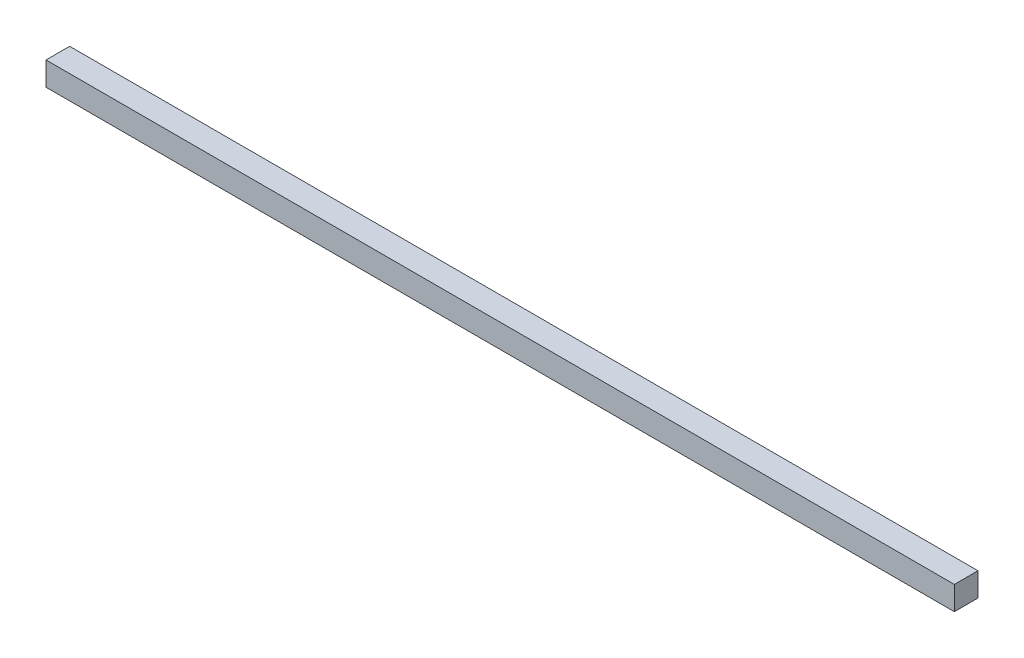
ISO-10303-21;
HEADER;
FILE_DESCRIPTION(('STEP AP214'),'2;1');
FILE_NAME('part.step','',(''),(''),'','','');
FILE_SCHEMA(('AUTOMOTIVE_DESIGN { 1 0 10303 214 1 1 1 1 }'));
ENDSEC;
DATA;
#1=APPLICATION_CONTEXT('core data for automotive mechanical design processes');
#2=APPLICATION_PROTOCOL_DEFINITION('international standard','automotive_design',2000,#1);
#3=PRODUCT_CONTEXT('',#1,'mechanical');
#4=PRODUCT('Part','Part','',(#3));
#5=PRODUCT_RELATED_PRODUCT_CATEGORY('part','',(#4));
#6=PRODUCT_DEFINITION_FORMATION('','',#4);
#7=PRODUCT_DEFINITION_CONTEXT('part definition',#1,'design');
#8=PRODUCT_DEFINITION('design','',#6,#7);
#9=PRODUCT_DEFINITION_SHAPE('','',#8);
#10=(LENGTH_UNIT() NAMED_UNIT(*) SI_UNIT(.MILLI.,.METRE.));
#11=(NAMED_UNIT(*) PLANE_ANGLE_UNIT() SI_UNIT($,.RADIAN.));
#12=(NAMED_UNIT(*) SI_UNIT($,.STERADIAN.) SOLID_ANGLE_UNIT());
#13=UNCERTAINTY_MEASURE_WITH_UNIT(LENGTH_MEASURE(1.E-05),#10,'distance_accuracy_value','');
#14=(GEOMETRIC_REPRESENTATION_CONTEXT(3) GLOBAL_UNCERTAINTY_ASSIGNED_CONTEXT((#13)) GLOBAL_UNIT_ASSIGNED_CONTEXT((#10,
#11,#12)) REPRESENTATION_CONTEXT('',''));
#15=CARTESIAN_POINT('',(0.,0.,0.));
#16=DIRECTION('',(0.,0.,1.));
#17=DIRECTION('',(1.,0.,0.));
#18=AXIS2_PLACEMENT_3D('',#15,#16,#17);
#19=CARTESIAN_POINT('',(-8.88178419700125E-13,25.4000000000003,0.));
#20=DIRECTION('',(1.,0.,0.));
#21=DIRECTION('',(0.,0.,-1.));
#22=AXIS2_PLACEMENT_3D('',#19,#20,#21);
#23=PLANE('',#22);
#24=DIRECTION('',(0.,0.,1.));
#25=VECTOR('',#24,1.);
#26=CARTESIAN_POINT('',(0.,0.,0.));
#27=LINE('',#26,#25);
#28=CARTESIAN_POINT('',(0.,0.,-25.4000000000001));
#29=VERTEX_POINT('',#28);
#30=CARTESIAN_POINT('',(0.,0.,0.));
#31=VERTEX_POINT('',#30);
#32=EDGE_CURVE('E97',#29,#31,#27,.T.);
#33=ORIENTED_EDGE('',*,*,#32,.T.);
#34=DIRECTION('',(0.,-1.,0.));
#35=VECTOR('',#34,1.);
#36=CARTESIAN_POINT('',(-8.88178419700125E-13,25.4000000000003,0.));
#37=LINE('',#36,#35);
#38=CARTESIAN_POINT('',(-8.88178419700125E-13,25.4000000000003,0.));
#39=VERTEX_POINT('',#38);
#40=EDGE_CURVE('E11',#39,#31,#37,.T.);
#41=ORIENTED_EDGE('',*,*,#40,.F.);
#42=DIRECTION('',(0.,0.,1.));
#43=VECTOR('',#42,1.);
#44=CARTESIAN_POINT('',(-8.88178419700125E-13,25.4000000000003,0.));
#45=LINE('',#44,#43);
#46=CARTESIAN_POINT('',(-8.88178419700125E-13,25.4000000000003,-25.4000000000001));
#47=VERTEX_POINT('',#46);
#48=EDGE_CURVE('E85',#47,#39,#45,.T.);
#49=ORIENTED_EDGE('',*,*,#48,.F.);
#50=DIRECTION('',(0.,-1.,0.));
#51=VECTOR('',#50,1.);
#52=CARTESIAN_POINT('',(-8.88178419700125E-13,25.4000000000003,-25.4000000000001));
#53=LINE('',#52,#51);
#54=EDGE_CURVE('E93',#47,#29,#53,.T.);
#55=ORIENTED_EDGE('',*,*,#54,.T.);
#56=EDGE_LOOP('',(#33,#41,#49,#55));
#57=FACE_BOUND('',#56,.T.);
#58=ADVANCED_FACE('F34',(#57),#23,.F.);
#59=CARTESIAN_POINT('',(-8.88178419700125E-13,25.4000000000003,0.));
#60=DIRECTION('',(0.,0.,-1.));
#61=DIRECTION('',(-1.,0.,0.));
#62=AXIS2_PLACEMENT_3D('',#59,#60,#61);
#63=PLANE('',#62);
#64=DIRECTION('',(1.,0.,0.));
#65=VECTOR('',#64,1.);
#66=CARTESIAN_POINT('',(0.,0.,0.));
#67=LINE('',#66,#65);
#68=CARTESIAN_POINT('',(975.537386994473,8.88178419700125E-13,0.));
#69=VERTEX_POINT('',#68);
#70=EDGE_CURVE('E89',#31,#69,#67,.T.);
#71=ORIENTED_EDGE('',*,*,#70,.T.);
#72=DIRECTION('',(0.,-1.,0.));
#73=VECTOR('',#72,1.);
#74=CARTESIAN_POINT('',(975.537386994472,25.4000000000003,0.));
#75=LINE('',#74,#73);
#76=CARTESIAN_POINT('',(975.537386994472,25.4000000000003,0.));
#77=VERTEX_POINT('',#76);
#78=EDGE_CURVE('E42',#77,#69,#75,.T.);
#79=ORIENTED_EDGE('',*,*,#78,.F.);
#80=DIRECTION('',(1.,0.,0.));
#81=VECTOR('',#80,1.);
#82=CARTESIAN_POINT('',(-8.88178419700125E-13,25.4000000000003,0.));
#83=LINE('',#82,#81);
#84=EDGE_CURVE('E80',#39,#77,#83,.T.);
#85=ORIENTED_EDGE('',*,*,#84,.F.);
#86=ORIENTED_EDGE('',*,*,#40,.T.);
#87=EDGE_LOOP('',(#71,#79,#85,#86));
#88=FACE_BOUND('',#87,.T.);
#89=ADVANCED_FACE('F88',(#88),#63,.F.);
#90=CARTESIAN_POINT('',(975.537386994472,25.4000000000003,0.));
#91=DIRECTION('',(-1.,0.,0.));
#92=DIRECTION('',(0.,0.,1.));
#93=AXIS2_PLACEMENT_3D('',#90,#91,#92);
#94=PLANE('',#93);
#95=DIRECTION('',(0.,0.,-1.));
#96=VECTOR('',#95,1.);
#97=CARTESIAN_POINT('',(975.537386994473,8.88178419700125E-13,0.));
#98=LINE('',#97,#96);
#99=CARTESIAN_POINT('',(975.537386994473,8.88178419700125E-13,-25.4000000000001));
#100=VERTEX_POINT('',#99);
#101=EDGE_CURVE('E67',#69,#100,#98,.T.);
#102=ORIENTED_EDGE('',*,*,#101,.T.);
#103=DIRECTION('',(0.,-1.,0.));
#104=VECTOR('',#103,1.);
#105=CARTESIAN_POINT('',(975.537386994472,25.4000000000003,-25.4000000000001));
#106=LINE('',#105,#104);
#107=CARTESIAN_POINT('',(975.537386994472,25.4000000000003,-25.4000000000001));
#108=VERTEX_POINT('',#107);
#109=EDGE_CURVE('E90',#108,#100,#106,.T.);
#110=ORIENTED_EDGE('',*,*,#109,.F.);
#111=DIRECTION('',(0.,0.,-1.));
#112=VECTOR('',#111,1.);
#113=CARTESIAN_POINT('',(975.537386994472,25.4000000000003,0.));
#114=LINE('',#113,#112);
#115=EDGE_CURVE('E83',#77,#108,#114,.T.);
#116=ORIENTED_EDGE('',*,*,#115,.F.);
#117=ORIENTED_EDGE('',*,*,#78,.T.);
#118=EDGE_LOOP('',(#102,#110,#116,#117));
#119=FACE_BOUND('',#118,.T.);
#120=ADVANCED_FACE('F91',(#119),#94,.F.);
#121=CARTESIAN_POINT('',(-8.88178419700125E-13,25.4000000000003,-25.4000000000001));
#122=DIRECTION('',(0.,0.,1.));
#123=DIRECTION('',(1.,0.,0.));
#124=AXIS2_PLACEMENT_3D('',#121,#122,#123);
#125=PLANE('',#124);
#126=DIRECTION('',(-1.,0.,0.));
#127=VECTOR('',#126,1.);
#128=CARTESIAN_POINT('',(0.,0.,-25.4000000000001));
#129=LINE('',#128,#127);
#130=EDGE_CURVE('E73',#100,#29,#129,.T.);
#131=ORIENTED_EDGE('',*,*,#130,.T.);
#132=ORIENTED_EDGE('',*,*,#54,.F.);
#133=DIRECTION('',(-1.,0.,0.));
#134=VECTOR('',#133,1.);
#135=CARTESIAN_POINT('',(-8.88178419700125E-13,25.4000000000003,-25.4000000000001));
#136=LINE('',#135,#134);
#137=EDGE_CURVE('E50',#108,#47,#136,.T.);
#138=ORIENTED_EDGE('',*,*,#137,.F.);
#139=ORIENTED_EDGE('',*,*,#109,.T.);
#140=EDGE_LOOP('',(#131,#132,#138,#139));
#141=FACE_BOUND('',#140,.T.);
#142=ADVANCED_FACE('F104',(#141),#125,.F.);
#143=CARTESIAN_POINT('',(-8.88178419700125E-13,25.4000000000003,0.));
#144=DIRECTION('',(0.,-1.,0.));
#145=DIRECTION('',(0.,0.,-1.));
#146=AXIS2_PLACEMENT_3D('',#143,#144,#145);
#147=PLANE('',#146);
#148=ORIENTED_EDGE('',*,*,#48,.T.);
#149=ORIENTED_EDGE('',*,*,#84,.T.);
#150=ORIENTED_EDGE('',*,*,#115,.T.);
#151=ORIENTED_EDGE('',*,*,#137,.T.);
#152=EDGE_LOOP('',(#148,#149,#150,#151));
#153=FACE_BOUND('',#152,.T.);
#154=ADVANCED_FACE('F81',(#153),#147,.F.);
#155=CARTESIAN_POINT('',(0.,0.,0.));
#156=DIRECTION('',(0.,-1.,0.));
#157=DIRECTION('',(0.,0.,-1.));
#158=AXIS2_PLACEMENT_3D('',#155,#156,#157);
#159=PLANE('',#158);
#160=ORIENTED_EDGE('',*,*,#32,.F.);
#161=ORIENTED_EDGE('',*,*,#130,.F.);
#162=ORIENTED_EDGE('',*,*,#101,.F.);
#163=ORIENTED_EDGE('',*,*,#70,.F.);
#164=EDGE_LOOP('',(#160,#161,#162,#163));
#165=FACE_BOUND('',#164,.T.);
#166=ADVANCED_FACE('F107',(#165),#159,.T.);
#167=CLOSED_SHELL('',(#58,#89,#120,#142,#154,#166));
#168=MANIFOLD_SOLID_BREP('B2',#167);
#169=ADVANCED_BREP_SHAPE_REPRESENTATION('',(#18,#168),#14);
#170=SHAPE_DEFINITION_REPRESENTATION(#9,#169);
ENDSEC;
END-ISO-10303-21;
